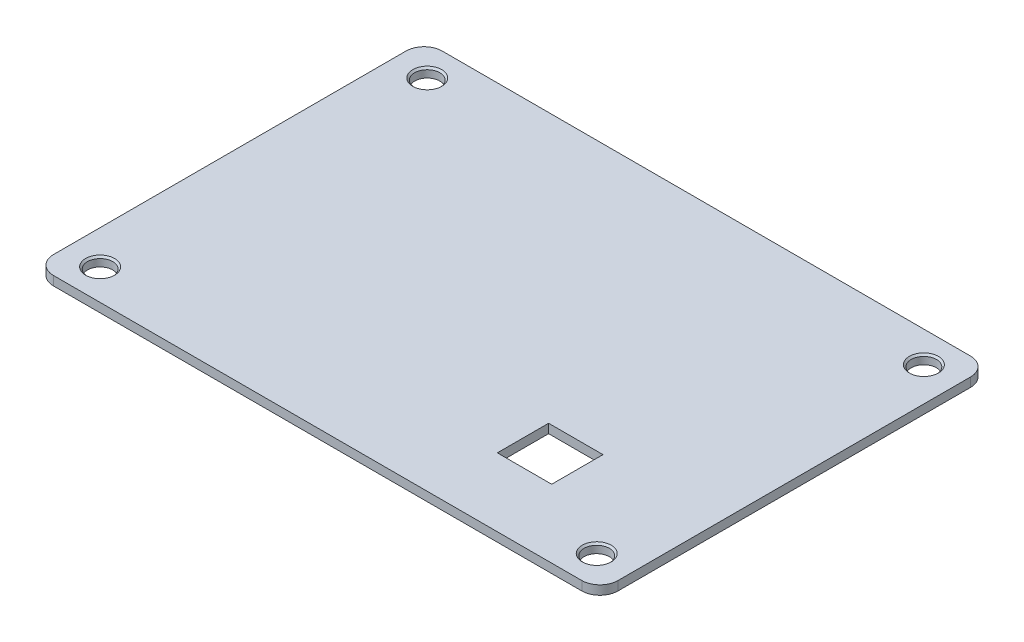
ISO-10303-21;
HEADER;
FILE_DESCRIPTION(('STEP AP214'),'2;1');
FILE_NAME('part.step','',(''),(''),'','','');
FILE_SCHEMA(('AUTOMOTIVE_DESIGN { 1 0 10303 214 1 1 1 1 }'));
ENDSEC;
DATA;
#1=APPLICATION_CONTEXT('core data for automotive mechanical design processes');
#2=APPLICATION_PROTOCOL_DEFINITION('international standard','automotive_design',2000,#1);
#3=PRODUCT_CONTEXT('',#1,'mechanical');
#4=PRODUCT('Part','Part','',(#3));
#5=PRODUCT_RELATED_PRODUCT_CATEGORY('part','',(#4));
#6=PRODUCT_DEFINITION_FORMATION('','',#4);
#7=PRODUCT_DEFINITION_CONTEXT('part definition',#1,'design');
#8=PRODUCT_DEFINITION('design','',#6,#7);
#9=PRODUCT_DEFINITION_SHAPE('','',#8);
#10=(LENGTH_UNIT() NAMED_UNIT(*) SI_UNIT(.MILLI.,.METRE.));
#11=(NAMED_UNIT(*) PLANE_ANGLE_UNIT() SI_UNIT($,.RADIAN.));
#12=(NAMED_UNIT(*) SI_UNIT($,.STERADIAN.) SOLID_ANGLE_UNIT());
#13=UNCERTAINTY_MEASURE_WITH_UNIT(LENGTH_MEASURE(1.E-05),#10,'distance_accuracy_value','');
#14=(GEOMETRIC_REPRESENTATION_CONTEXT(3) GLOBAL_UNCERTAINTY_ASSIGNED_CONTEXT((#13)) GLOBAL_UNIT_ASSIGNED_CONTEXT((#10,
#11,#12)) REPRESENTATION_CONTEXT('',''));
#15=CARTESIAN_POINT('',(0.,0.,0.));
#16=DIRECTION('',(0.,0.,1.));
#17=DIRECTION('',(1.,0.,0.));
#18=AXIS2_PLACEMENT_3D('',#15,#16,#17);
#19=CARTESIAN_POINT('',(0.,1.,0.));
#20=DIRECTION('',(0.,-1.,0.));
#21=DIRECTION('',(0.,0.,-1.));
#22=AXIS2_PLACEMENT_3D('',#19,#20,#21);
#23=PLANE('',#22);
#24=CARTESIAN_POINT('',(27.4,1.,-18.05));
#25=DIRECTION('',(0.,-1.,0.));
#26=DIRECTION('',(0.,0.,-1.));
#27=AXIS2_PLACEMENT_3D('',#24,#25,#26);
#28=CIRCLE('',#27,1.6);
#29=CARTESIAN_POINT('',(27.4,1.,-19.65));
#30=VERTEX_POINT('',#29);
#31=EDGE_CURVE('E247',#30,#30,#28,.T.);
#32=ORIENTED_EDGE('',*,*,#31,.T.);
#33=EDGE_LOOP('',(#32));
#34=FACE_BOUND('',#33,.T.);
#35=CARTESIAN_POINT('',(27.4,1.,18.05));
#36=DIRECTION('',(0.,-1.,0.));
#37=DIRECTION('',(0.,0.,-1.));
#38=AXIS2_PLACEMENT_3D('',#35,#36,#37);
#39=CIRCLE('',#38,1.6);
#40=CARTESIAN_POINT('',(27.4,1.,16.45));
#41=VERTEX_POINT('',#40);
#42=EDGE_CURVE('E244',#41,#41,#39,.T.);
#43=ORIENTED_EDGE('',*,*,#42,.T.);
#44=EDGE_LOOP('',(#43));
#45=FACE_BOUND('',#44,.T.);
#46=CARTESIAN_POINT('',(-27.4,1.,18.05));
#47=DIRECTION('',(0.,-1.,0.));
#48=DIRECTION('',(0.,0.,-1.));
#49=AXIS2_PLACEMENT_3D('',#46,#47,#48);
#50=CIRCLE('',#49,1.59999999999998);
#51=CARTESIAN_POINT('',(-27.4,1.,16.45));
#52=VERTEX_POINT('',#51);
#53=EDGE_CURVE('E241',#52,#52,#50,.T.);
#54=ORIENTED_EDGE('',*,*,#53,.T.);
#55=EDGE_LOOP('',(#54));
#56=FACE_BOUND('',#55,.T.);
#57=CARTESIAN_POINT('',(-27.4,1.,-18.05));
#58=DIRECTION('',(0.,-1.,0.));
#59=DIRECTION('',(0.,0.,-1.));
#60=AXIS2_PLACEMENT_3D('',#57,#58,#59);
#61=CIRCLE('',#60,1.6);
#62=CARTESIAN_POINT('',(-27.4,1.,-19.65));
#63=VERTEX_POINT('',#62);
#64=EDGE_CURVE('E238',#63,#63,#61,.T.);
#65=ORIENTED_EDGE('',*,*,#64,.T.);
#66=EDGE_LOOP('',(#65));
#67=FACE_BOUND('',#66,.T.);
#68=DIRECTION('',(0.,0.,-1.));
#69=VECTOR('',#68,1.);
#70=CARTESIAN_POINT('',(18.29,1.,13.91));
#71=LINE('',#70,#69);
#72=CARTESIAN_POINT('',(18.29,1.,13.91));
#73=VERTEX_POINT('',#72);
#74=CARTESIAN_POINT('',(18.29,1.,8.25));
#75=VERTEX_POINT('',#74);
#76=EDGE_CURVE('E146',#73,#75,#71,.T.);
#77=ORIENTED_EDGE('',*,*,#76,.F.);
#78=DIRECTION('',(1.,0.,0.));
#79=VECTOR('',#78,1.);
#80=CARTESIAN_POINT('',(12.29,1.,13.91));
#81=LINE('',#80,#79);
#82=CARTESIAN_POINT('',(12.29,1.,13.91));
#83=VERTEX_POINT('',#82);
#84=EDGE_CURVE('E151',#83,#73,#81,.T.);
#85=ORIENTED_EDGE('',*,*,#84,.F.);
#86=DIRECTION('',(0.,0.,-1.));
#87=VECTOR('',#86,1.);
#88=CARTESIAN_POINT('',(12.29,1.,13.91));
#89=LINE('',#88,#87);
#90=CARTESIAN_POINT('',(12.29,1.,8.25));
#91=VERTEX_POINT('',#90);
#92=EDGE_CURVE('E154',#83,#91,#89,.T.);
#93=ORIENTED_EDGE('',*,*,#92,.T.);
#94=DIRECTION('',(1.,0.,0.));
#95=VECTOR('',#94,1.);
#96=CARTESIAN_POINT('',(12.29,1.,8.25));
#97=LINE('',#96,#95);
#98=EDGE_CURVE('E135',#91,#75,#97,.T.);
#99=ORIENTED_EDGE('',*,*,#98,.T.);
#100=EDGE_LOOP('',(#77,#85,#93,#99));
#101=FACE_BOUND('',#100,.T.);
#102=DIRECTION('',(0.,0.,1.));
#103=VECTOR('',#102,1.);
#104=CARTESIAN_POINT('',(-31.15,1.,21.45));
#105=LINE('',#104,#103);
#106=CARTESIAN_POINT('',(-31.15,1.,-19.45));
#107=VERTEX_POINT('',#106);
#108=CARTESIAN_POINT('',(-31.15,1.,19.45));
#109=VERTEX_POINT('',#108);
#110=EDGE_CURVE('E169',#107,#109,#105,.T.);
#111=ORIENTED_EDGE('',*,*,#110,.T.);
#112=CARTESIAN_POINT('',(-29.15,1.,19.45));
#113=DIRECTION('',(0.,-1.,0.));
#114=DIRECTION('',(0.,0.,-1.));
#115=AXIS2_PLACEMENT_3D('',#112,#113,#114);
#116=CIRCLE('',#115,2.);
#117=CARTESIAN_POINT('',(-29.15,1.,21.45));
#118=VERTEX_POINT('',#117);
#119=EDGE_CURVE('E227',#109,#118,#116,.F.);
#120=ORIENTED_EDGE('',*,*,#119,.T.);
#121=DIRECTION('',(1.,0.,0.));
#122=VECTOR('',#121,1.);
#123=CARTESIAN_POINT('',(-31.15,1.,21.45));
#124=LINE('',#123,#122);
#125=CARTESIAN_POINT('',(29.15,1.,21.45));
#126=VERTEX_POINT('',#125);
#127=EDGE_CURVE('E172',#118,#126,#124,.T.);
#128=ORIENTED_EDGE('',*,*,#127,.T.);
#129=CARTESIAN_POINT('',(29.15,1.,19.45));
#130=DIRECTION('',(0.,-1.,0.));
#131=DIRECTION('',(0.,0.,-1.));
#132=AXIS2_PLACEMENT_3D('',#129,#130,#131);
#133=CIRCLE('',#132,2.);
#134=CARTESIAN_POINT('',(31.15,1.,19.45));
#135=VERTEX_POINT('',#134);
#136=EDGE_CURVE('E225',#126,#135,#133,.F.);
#137=ORIENTED_EDGE('',*,*,#136,.T.);
#138=DIRECTION('',(0.,0.,-1.));
#139=VECTOR('',#138,1.);
#140=CARTESIAN_POINT('',(31.15,1.,21.45));
#141=LINE('',#140,#139);
#142=CARTESIAN_POINT('',(31.15,1.,-19.45));
#143=VERTEX_POINT('',#142);
#144=EDGE_CURVE('E164',#135,#143,#141,.T.);
#145=ORIENTED_EDGE('',*,*,#144,.T.);
#146=CARTESIAN_POINT('',(29.15,1.,-19.45));
#147=DIRECTION('',(0.,-1.,0.));
#148=DIRECTION('',(0.,0.,-1.));
#149=AXIS2_PLACEMENT_3D('',#146,#147,#148);
#150=CIRCLE('',#149,2.);
#151=CARTESIAN_POINT('',(29.15,1.,-21.45));
#152=VERTEX_POINT('',#151);
#153=EDGE_CURVE('E61',#143,#152,#150,.F.);
#154=ORIENTED_EDGE('',*,*,#153,.T.);
#155=DIRECTION('',(-1.,0.,0.));
#156=VECTOR('',#155,1.);
#157=CARTESIAN_POINT('',(-31.15,1.,-21.45));
#158=LINE('',#157,#156);
#159=CARTESIAN_POINT('',(-29.15,1.,-21.45));
#160=VERTEX_POINT('',#159);
#161=EDGE_CURVE('E166',#152,#160,#158,.T.);
#162=ORIENTED_EDGE('',*,*,#161,.T.);
#163=CARTESIAN_POINT('',(-29.15,1.,-19.45));
#164=DIRECTION('',(0.,-1.,0.));
#165=DIRECTION('',(0.,0.,-1.));
#166=AXIS2_PLACEMENT_3D('',#163,#164,#165);
#167=CIRCLE('',#166,2.);
#168=EDGE_CURVE('E222',#160,#107,#167,.F.);
#169=ORIENTED_EDGE('',*,*,#168,.T.);
#170=EDGE_LOOP('',(#111,#120,#128,#137,#145,#154,#162,#169));
#171=FACE_BOUND('',#170,.T.);
#172=ADVANCED_FACE('F38',(#34,#45,#56,#67,#101,#171),#23,.F.);
#173=CARTESIAN_POINT('',(0.,0.,0.));
#174=DIRECTION('',(0.,-1.,0.));
#175=DIRECTION('',(0.,0.,-1.));
#176=AXIS2_PLACEMENT_3D('',#173,#174,#175);
#177=PLANE('',#176);
#178=CARTESIAN_POINT('',(-27.4,0.,18.05));
#179=DIRECTION('',(0.,-1.,0.));
#180=DIRECTION('',(0.,0.,-1.));
#181=AXIS2_PLACEMENT_3D('',#178,#179,#180);
#182=CIRCLE('',#181,1.4);
#183=CARTESIAN_POINT('',(-27.4,0.,16.65));
#184=VERTEX_POINT('',#183);
#185=EDGE_CURVE('E199',#184,#184,#182,.F.);
#186=ORIENTED_EDGE('',*,*,#185,.T.);
#187=EDGE_LOOP('',(#186));
#188=FACE_BOUND('',#187,.T.);
#189=CARTESIAN_POINT('',(27.4,0.,-18.05));
#190=DIRECTION('',(0.,-1.,0.));
#191=DIRECTION('',(0.,0.,-1.));
#192=AXIS2_PLACEMENT_3D('',#189,#190,#191);
#193=CIRCLE('',#192,1.4);
#194=CARTESIAN_POINT('',(27.4,0.,-19.45));
#195=VERTEX_POINT('',#194);
#196=EDGE_CURVE('E193',#195,#195,#193,.F.);
#197=ORIENTED_EDGE('',*,*,#196,.T.);
#198=EDGE_LOOP('',(#197));
#199=FACE_BOUND('',#198,.T.);
#200=DIRECTION('',(-1.,0.,0.));
#201=VECTOR('',#200,1.);
#202=CARTESIAN_POINT('',(0.,0.,13.91));
#203=LINE('',#202,#201);
#204=CARTESIAN_POINT('',(18.29,0.,13.91));
#205=VERTEX_POINT('',#204);
#206=CARTESIAN_POINT('',(12.29,0.,13.91));
#207=VERTEX_POINT('',#206);
#208=EDGE_CURVE('E190',#205,#207,#203,.T.);
#209=ORIENTED_EDGE('',*,*,#208,.F.);
#210=DIRECTION('',(0.,0.,1.));
#211=VECTOR('',#210,1.);
#212=CARTESIAN_POINT('',(18.29,0.,0.));
#213=LINE('',#212,#211);
#214=CARTESIAN_POINT('',(18.29,0.,8.25));
#215=VERTEX_POINT('',#214);
#216=EDGE_CURVE('E175',#215,#205,#213,.T.);
#217=ORIENTED_EDGE('',*,*,#216,.F.);
#218=DIRECTION('',(-1.,0.,0.));
#219=VECTOR('',#218,1.);
#220=CARTESIAN_POINT('',(0.,0.,8.25));
#221=LINE('',#220,#219);
#222=CARTESIAN_POINT('',(12.29,0.,8.25));
#223=VERTEX_POINT('',#222);
#224=EDGE_CURVE('E138',#215,#223,#221,.T.);
#225=ORIENTED_EDGE('',*,*,#224,.T.);
#226=DIRECTION('',(0.,0.,1.));
#227=VECTOR('',#226,1.);
#228=CARTESIAN_POINT('',(12.29,0.,0.));
#229=LINE('',#228,#227);
#230=EDGE_CURVE('E187',#223,#207,#229,.T.);
#231=ORIENTED_EDGE('',*,*,#230,.T.);
#232=EDGE_LOOP('',(#209,#217,#225,#231));
#233=FACE_BOUND('',#232,.T.);
#234=DIRECTION('',(1.,0.,0.));
#235=VECTOR('',#234,1.);
#236=CARTESIAN_POINT('',(-31.15,0.,21.45));
#237=LINE('',#236,#235);
#238=CARTESIAN_POINT('',(-29.15,0.,21.45));
#239=VERTEX_POINT('',#238);
#240=CARTESIAN_POINT('',(29.15,0.,21.45));
#241=VERTEX_POINT('',#240);
#242=EDGE_CURVE('E167',#239,#241,#237,.T.);
#243=ORIENTED_EDGE('',*,*,#242,.F.);
#244=CARTESIAN_POINT('',(-29.15,0.,19.45));
#245=DIRECTION('',(0.,-1.,0.));
#246=DIRECTION('',(0.,0.,-1.));
#247=AXIS2_PLACEMENT_3D('',#244,#245,#246);
#248=CIRCLE('',#247,2.);
#249=CARTESIAN_POINT('',(-31.15,0.,19.45));
#250=VERTEX_POINT('',#249);
#251=EDGE_CURVE('E215',#239,#250,#248,.T.);
#252=ORIENTED_EDGE('',*,*,#251,.T.);
#253=DIRECTION('',(0.,0.,1.));
#254=VECTOR('',#253,1.);
#255=CARTESIAN_POINT('',(-31.15,0.,21.45));
#256=LINE('',#255,#254);
#257=CARTESIAN_POINT('',(-31.15,0.,-19.45));
#258=VERTEX_POINT('',#257);
#259=EDGE_CURVE('E180',#258,#250,#256,.T.);
#260=ORIENTED_EDGE('',*,*,#259,.F.);
#261=CARTESIAN_POINT('',(-29.15,0.,-19.45));
#262=DIRECTION('',(0.,-1.,0.));
#263=DIRECTION('',(0.,0.,-1.));
#264=AXIS2_PLACEMENT_3D('',#261,#262,#263);
#265=CIRCLE('',#264,2.);
#266=CARTESIAN_POINT('',(-29.15,0.,-21.45));
#267=VERTEX_POINT('',#266);
#268=EDGE_CURVE('E209',#258,#267,#265,.T.);
#269=ORIENTED_EDGE('',*,*,#268,.T.);
#270=DIRECTION('',(-1.,0.,0.));
#271=VECTOR('',#270,1.);
#272=CARTESIAN_POINT('',(-31.15,0.,-21.45));
#273=LINE('',#272,#271);
#274=CARTESIAN_POINT('',(29.15,0.,-21.45));
#275=VERTEX_POINT('',#274);
#276=EDGE_CURVE('E178',#275,#267,#273,.T.);
#277=ORIENTED_EDGE('',*,*,#276,.F.);
#278=CARTESIAN_POINT('',(29.15,0.,-19.45));
#279=DIRECTION('',(0.,-1.,0.));
#280=DIRECTION('',(0.,0.,-1.));
#281=AXIS2_PLACEMENT_3D('',#278,#279,#280);
#282=CIRCLE('',#281,2.);
#283=CARTESIAN_POINT('',(31.15,0.,-19.45));
#284=VERTEX_POINT('',#283);
#285=EDGE_CURVE('E211',#275,#284,#282,.T.);
#286=ORIENTED_EDGE('',*,*,#285,.T.);
#287=DIRECTION('',(0.,0.,-1.));
#288=VECTOR('',#287,1.);
#289=CARTESIAN_POINT('',(31.15,0.,21.45));
#290=LINE('',#289,#288);
#291=CARTESIAN_POINT('',(31.15,0.,19.45));
#292=VERTEX_POINT('',#291);
#293=EDGE_CURVE('E161',#292,#284,#290,.T.);
#294=ORIENTED_EDGE('',*,*,#293,.F.);
#295=CARTESIAN_POINT('',(29.15,0.,19.45));
#296=DIRECTION('',(0.,-1.,0.));
#297=DIRECTION('',(0.,0.,-1.));
#298=AXIS2_PLACEMENT_3D('',#295,#296,#297);
#299=CIRCLE('',#298,2.);
#300=EDGE_CURVE('E213',#292,#241,#299,.T.);
#301=ORIENTED_EDGE('',*,*,#300,.T.);
#302=EDGE_LOOP('',(#243,#252,#260,#269,#277,#286,#294,#301));
#303=FACE_BOUND('',#302,.T.);
#304=CARTESIAN_POINT('',(27.4,0.,18.05));
#305=DIRECTION('',(0.,-1.,0.));
#306=DIRECTION('',(0.,0.,-1.));
#307=AXIS2_PLACEMENT_3D('',#304,#305,#306);
#308=CIRCLE('',#307,1.4);
#309=CARTESIAN_POINT('',(27.4,0.,16.65));
#310=VERTEX_POINT('',#309);
#311=EDGE_CURVE('E196',#310,#310,#308,.T.);
#312=ORIENTED_EDGE('',*,*,#311,.F.);
#313=EDGE_LOOP('',(#312));
#314=FACE_BOUND('',#313,.T.);
#315=CARTESIAN_POINT('',(-27.4,0.,-18.05));
#316=DIRECTION('',(0.,-1.,0.));
#317=DIRECTION('',(0.,0.,-1.));
#318=AXIS2_PLACEMENT_3D('',#315,#316,#317);
#319=CIRCLE('',#318,1.4);
#320=CARTESIAN_POINT('',(-27.4,0.,-19.45));
#321=VERTEX_POINT('',#320);
#322=EDGE_CURVE('E202',#321,#321,#319,.T.);
#323=ORIENTED_EDGE('',*,*,#322,.F.);
#324=EDGE_LOOP('',(#323));
#325=FACE_BOUND('',#324,.T.);
#326=ADVANCED_FACE('F269',(#188,#199,#233,#303,#314,#325),#177,.T.);
#327=CARTESIAN_POINT('',(31.15,1.,21.45));
#328=DIRECTION('',(-1.,0.,0.));
#329=DIRECTION('',(0.,0.,1.));
#330=AXIS2_PLACEMENT_3D('',#327,#328,#329);
#331=PLANE('',#330);
#332=ORIENTED_EDGE('',*,*,#144,.F.);
#333=DIRECTION('',(0.,-1.,0.));
#334=VECTOR('',#333,1.);
#335=CARTESIAN_POINT('',(31.15,1.,19.45));
#336=LINE('',#335,#334);
#337=EDGE_CURVE('E231',#135,#292,#336,.T.);
#338=ORIENTED_EDGE('',*,*,#337,.T.);
#339=ORIENTED_EDGE('',*,*,#293,.T.);
#340=DIRECTION('',(0.,-1.,0.));
#341=VECTOR('',#340,1.);
#342=CARTESIAN_POINT('',(31.15,1.,-19.45));
#343=LINE('',#342,#341);
#344=EDGE_CURVE('E229',#284,#143,#343,.F.);
#345=ORIENTED_EDGE('',*,*,#344,.T.);
#346=EDGE_LOOP('',(#332,#338,#339,#345));
#347=FACE_BOUND('',#346,.T.);
#348=ADVANCED_FACE('F286',(#347),#331,.F.);
#349=CARTESIAN_POINT('',(-31.15,1.,-21.45));
#350=DIRECTION('',(0.,0.,1.));
#351=DIRECTION('',(1.,0.,0.));
#352=AXIS2_PLACEMENT_3D('',#349,#350,#351);
#353=PLANE('',#352);
#354=ORIENTED_EDGE('',*,*,#161,.F.);
#355=DIRECTION('',(0.,-1.,0.));
#356=VECTOR('',#355,1.);
#357=CARTESIAN_POINT('',(29.15,1.,-21.45));
#358=LINE('',#357,#356);
#359=EDGE_CURVE('E235',#152,#275,#358,.T.);
#360=ORIENTED_EDGE('',*,*,#359,.T.);
#361=ORIENTED_EDGE('',*,*,#276,.T.);
#362=DIRECTION('',(0.,-1.,0.));
#363=VECTOR('',#362,1.);
#364=CARTESIAN_POINT('',(-29.15,1.,-21.45));
#365=LINE('',#364,#363);
#366=EDGE_CURVE('E54',#267,#160,#365,.F.);
#367=ORIENTED_EDGE('',*,*,#366,.T.);
#368=EDGE_LOOP('',(#354,#360,#361,#367));
#369=FACE_BOUND('',#368,.T.);
#370=ADVANCED_FACE('F292',(#369),#353,.F.);
#371=CARTESIAN_POINT('',(-31.15,1.,21.45));
#372=DIRECTION('',(1.,0.,0.));
#373=DIRECTION('',(0.,0.,-1.));
#374=AXIS2_PLACEMENT_3D('',#371,#372,#373);
#375=PLANE('',#374);
#376=ORIENTED_EDGE('',*,*,#259,.T.);
#377=DIRECTION('',(0.,-1.,0.));
#378=VECTOR('',#377,1.);
#379=CARTESIAN_POINT('',(-31.15,1.,19.45));
#380=LINE('',#379,#378);
#381=EDGE_CURVE('E220',#250,#109,#380,.F.);
#382=ORIENTED_EDGE('',*,*,#381,.T.);
#383=ORIENTED_EDGE('',*,*,#110,.F.);
#384=DIRECTION('',(0.,-1.,0.));
#385=VECTOR('',#384,1.);
#386=CARTESIAN_POINT('',(-31.15,1.,-19.45));
#387=LINE('',#386,#385);
#388=EDGE_CURVE('E217',#107,#258,#387,.T.);
#389=ORIENTED_EDGE('',*,*,#388,.T.);
#390=EDGE_LOOP('',(#376,#382,#383,#389));
#391=FACE_BOUND('',#390,.T.);
#392=ADVANCED_FACE('F302',(#391),#375,.F.);
#393=CARTESIAN_POINT('',(-31.15,1.,21.45));
#394=DIRECTION('',(0.,0.,-1.));
#395=DIRECTION('',(-1.,0.,0.));
#396=AXIS2_PLACEMENT_3D('',#393,#394,#395);
#397=PLANE('',#396);
#398=ORIENTED_EDGE('',*,*,#127,.F.);
#399=DIRECTION('',(0.,-1.,0.));
#400=VECTOR('',#399,1.);
#401=CARTESIAN_POINT('',(-29.15,1.,21.45));
#402=LINE('',#401,#400);
#403=EDGE_CURVE('E206',#118,#239,#402,.T.);
#404=ORIENTED_EDGE('',*,*,#403,.T.);
#405=ORIENTED_EDGE('',*,*,#242,.T.);
#406=DIRECTION('',(0.,-1.,0.));
#407=VECTOR('',#406,1.);
#408=CARTESIAN_POINT('',(29.15,1.,21.45));
#409=LINE('',#408,#407);
#410=EDGE_CURVE('E192',#241,#126,#409,.F.);
#411=ORIENTED_EDGE('',*,*,#410,.T.);
#412=EDGE_LOOP('',(#398,#404,#405,#411));
#413=FACE_BOUND('',#412,.T.);
#414=ADVANCED_FACE('F298',(#413),#397,.F.);
#415=CARTESIAN_POINT('',(12.29,-6.,13.91));
#416=DIRECTION('',(0.,0.,1.));
#417=DIRECTION('',(1.,0.,0.));
#418=AXIS2_PLACEMENT_3D('',#415,#416,#417);
#419=PLANE('',#418);
#420=ORIENTED_EDGE('',*,*,#208,.T.);
#421=DIRECTION('',(0.,1.,0.));
#422=VECTOR('',#421,1.);
#423=CARTESIAN_POINT('',(12.29,-6.,13.91));
#424=LINE('',#423,#422);
#425=EDGE_CURVE('E159',#207,#83,#424,.T.);
#426=ORIENTED_EDGE('',*,*,#425,.T.);
#427=ORIENTED_EDGE('',*,*,#84,.T.);
#428=DIRECTION('',(0.,1.,0.));
#429=VECTOR('',#428,1.);
#430=CARTESIAN_POINT('',(18.29,-6.,13.91));
#431=LINE('',#430,#429);
#432=EDGE_CURVE('E142',#205,#73,#431,.T.);
#433=ORIENTED_EDGE('',*,*,#432,.F.);
#434=EDGE_LOOP('',(#420,#426,#427,#433));
#435=FACE_BOUND('',#434,.T.);
#436=ADVANCED_FACE('F301',(#435),#419,.F.);
#437=CARTESIAN_POINT('',(12.29,-6.,13.91));
#438=DIRECTION('',(1.,0.,0.));
#439=DIRECTION('',(0.,0.,-1.));
#440=AXIS2_PLACEMENT_3D('',#437,#438,#439);
#441=PLANE('',#440);
#442=DIRECTION('',(0.,1.,0.));
#443=VECTOR('',#442,1.);
#444=CARTESIAN_POINT('',(12.29,-6.,8.25));
#445=LINE('',#444,#443);
#446=EDGE_CURVE('E141',#223,#91,#445,.T.);
#447=ORIENTED_EDGE('',*,*,#446,.T.);
#448=ORIENTED_EDGE('',*,*,#92,.F.);
#449=ORIENTED_EDGE('',*,*,#425,.F.);
#450=ORIENTED_EDGE('',*,*,#230,.F.);
#451=EDGE_LOOP('',(#447,#448,#449,#450));
#452=FACE_BOUND('',#451,.T.);
#453=ADVANCED_FACE('F362',(#452),#441,.T.);
#454=CARTESIAN_POINT('',(12.29,-6.,8.25));
#455=DIRECTION('',(0.,0.,1.));
#456=DIRECTION('',(1.,0.,0.));
#457=AXIS2_PLACEMENT_3D('',#454,#455,#456);
#458=PLANE('',#457);
#459=DIRECTION('',(0.,1.,0.));
#460=VECTOR('',#459,1.);
#461=CARTESIAN_POINT('',(18.29,-6.,8.25));
#462=LINE('',#461,#460);
#463=EDGE_CURVE('E130',#215,#75,#462,.T.);
#464=ORIENTED_EDGE('',*,*,#463,.T.);
#465=ORIENTED_EDGE('',*,*,#98,.F.);
#466=ORIENTED_EDGE('',*,*,#446,.F.);
#467=ORIENTED_EDGE('',*,*,#224,.F.);
#468=EDGE_LOOP('',(#464,#465,#466,#467));
#469=FACE_BOUND('',#468,.T.);
#470=ADVANCED_FACE('F132',(#469),#458,.T.);
#471=CARTESIAN_POINT('',(18.29,-6.,13.91));
#472=DIRECTION('',(1.,0.,0.));
#473=DIRECTION('',(0.,0.,-1.));
#474=AXIS2_PLACEMENT_3D('',#471,#472,#473);
#475=PLANE('',#474);
#476=ORIENTED_EDGE('',*,*,#216,.T.);
#477=ORIENTED_EDGE('',*,*,#432,.T.);
#478=ORIENTED_EDGE('',*,*,#76,.T.);
#479=ORIENTED_EDGE('',*,*,#463,.F.);
#480=EDGE_LOOP('',(#476,#477,#478,#479));
#481=FACE_BOUND('',#480,.T.);
#482=ADVANCED_FACE('F147',(#481),#475,.F.);
#483=CARTESIAN_POINT('',(27.4,-9.,-18.05));
#484=DIRECTION('',(0.,1.,0.));
#485=DIRECTION('',(0.,0.,1.));
#486=AXIS2_PLACEMENT_3D('',#483,#484,#485);
#487=CYLINDRICAL_SURFACE('',#486,1.4);
#488=CARTESIAN_POINT('',(27.4,0.79999999999999,-18.05));
#489=DIRECTION('',(0.,-1.,0.));
#490=DIRECTION('',(0.,0.,-1.));
#491=AXIS2_PLACEMENT_3D('',#488,#489,#490);
#492=CIRCLE('',#491,1.4);
#493=CARTESIAN_POINT('',(27.4,0.79999999999999,-19.45));
#494=VERTEX_POINT('',#493);
#495=EDGE_CURVE('E250',#494,#494,#492,.F.);
#496=ORIENTED_EDGE('',*,*,#495,.T.);
#497=EDGE_LOOP('',(#496));
#498=FACE_BOUND('',#497,.T.);
#499=ORIENTED_EDGE('',*,*,#196,.F.);
#500=EDGE_LOOP('',(#499));
#501=FACE_BOUND('',#500,.T.);
#502=ADVANCED_FACE('F350',(#498,#501),#487,.F.);
#503=CARTESIAN_POINT('',(27.4,-9.,18.05));
#504=DIRECTION('',(0.,1.,0.));
#505=DIRECTION('',(0.,0.,1.));
#506=AXIS2_PLACEMENT_3D('',#503,#504,#505);
#507=CYLINDRICAL_SURFACE('',#506,1.4);
#508=CARTESIAN_POINT('',(27.4,0.800000000000004,18.05));
#509=DIRECTION('',(0.,-1.,0.));
#510=DIRECTION('',(0.,0.,-1.));
#511=AXIS2_PLACEMENT_3D('',#508,#509,#510);
#512=CIRCLE('',#511,1.4);
#513=CARTESIAN_POINT('',(27.4,0.800000000000004,16.65));
#514=VERTEX_POINT('',#513);
#515=EDGE_CURVE('E253',#514,#514,#512,.F.);
#516=ORIENTED_EDGE('',*,*,#515,.T.);
#517=EDGE_LOOP('',(#516));
#518=FACE_BOUND('',#517,.T.);
#519=ORIENTED_EDGE('',*,*,#311,.T.);
#520=EDGE_LOOP('',(#519));
#521=FACE_BOUND('',#520,.T.);
#522=ADVANCED_FACE('F347',(#518,#521),#507,.F.);
#523=CARTESIAN_POINT('',(-27.4,-9.,18.05));
#524=DIRECTION('',(0.,1.,0.));
#525=DIRECTION('',(0.,0.,1.));
#526=AXIS2_PLACEMENT_3D('',#523,#524,#525);
#527=CYLINDRICAL_SURFACE('',#526,1.4);
#528=CARTESIAN_POINT('',(-27.4,0.800000000000011,18.05));
#529=DIRECTION('',(0.,-1.,0.));
#530=DIRECTION('',(0.,0.,-1.));
#531=AXIS2_PLACEMENT_3D('',#528,#529,#530);
#532=CIRCLE('',#531,1.4);
#533=CARTESIAN_POINT('',(-27.4,0.800000000000011,16.65));
#534=VERTEX_POINT('',#533);
#535=EDGE_CURVE('E47',#534,#534,#532,.F.);
#536=ORIENTED_EDGE('',*,*,#535,.T.);
#537=EDGE_LOOP('',(#536));
#538=FACE_BOUND('',#537,.T.);
#539=ORIENTED_EDGE('',*,*,#185,.F.);
#540=EDGE_LOOP('',(#539));
#541=FACE_BOUND('',#540,.T.);
#542=ADVANCED_FACE('F258',(#538,#541),#527,.F.);
#543=CARTESIAN_POINT('',(-27.4,-9.,-18.05));
#544=DIRECTION('',(0.,1.,0.));
#545=DIRECTION('',(0.,0.,1.));
#546=AXIS2_PLACEMENT_3D('',#543,#544,#545);
#547=CYLINDRICAL_SURFACE('',#546,1.4);
#548=CARTESIAN_POINT('',(-27.4,0.800000000000004,-18.05));
#549=DIRECTION('',(0.,-1.,0.));
#550=DIRECTION('',(0.,0.,-1.));
#551=AXIS2_PLACEMENT_3D('',#548,#549,#550);
#552=CIRCLE('',#551,1.4);
#553=CARTESIAN_POINT('',(-27.4,0.800000000000004,-19.45));
#554=VERTEX_POINT('',#553);
#555=EDGE_CURVE('E11',#554,#554,#552,.F.);
#556=ORIENTED_EDGE('',*,*,#555,.T.);
#557=EDGE_LOOP('',(#556));
#558=FACE_BOUND('',#557,.T.);
#559=ORIENTED_EDGE('',*,*,#322,.T.);
#560=EDGE_LOOP('',(#559));
#561=FACE_BOUND('',#560,.T.);
#562=ADVANCED_FACE('F278',(#558,#561),#547,.F.);
#563=CARTESIAN_POINT('',(-29.15,1.,19.45));
#564=DIRECTION('',(0.,-1.,0.));
#565=DIRECTION('',(0.,0.,-1.));
#566=AXIS2_PLACEMENT_3D('',#563,#564,#565);
#567=CYLINDRICAL_SURFACE('',#566,2.);
#568=ORIENTED_EDGE('',*,*,#119,.F.);
#569=ORIENTED_EDGE('',*,*,#381,.F.);
#570=ORIENTED_EDGE('',*,*,#251,.F.);
#571=ORIENTED_EDGE('',*,*,#403,.F.);
#572=EDGE_LOOP('',(#568,#569,#570,#571));
#573=FACE_BOUND('',#572,.T.);
#574=ADVANCED_FACE('F281',(#573),#567,.T.);
#575=CARTESIAN_POINT('',(29.15,1.,19.45));
#576=DIRECTION('',(0.,-1.,0.));
#577=DIRECTION('',(0.,0.,-1.));
#578=AXIS2_PLACEMENT_3D('',#575,#576,#577);
#579=CYLINDRICAL_SURFACE('',#578,2.);
#580=ORIENTED_EDGE('',*,*,#136,.F.);
#581=ORIENTED_EDGE('',*,*,#410,.F.);
#582=ORIENTED_EDGE('',*,*,#300,.F.);
#583=ORIENTED_EDGE('',*,*,#337,.F.);
#584=EDGE_LOOP('',(#580,#581,#582,#583));
#585=FACE_BOUND('',#584,.T.);
#586=ADVANCED_FACE('F311',(#585),#579,.T.);
#587=CARTESIAN_POINT('',(29.15,1.,-19.45));
#588=DIRECTION('',(0.,-1.,0.));
#589=DIRECTION('',(0.,0.,-1.));
#590=AXIS2_PLACEMENT_3D('',#587,#588,#589);
#591=CYLINDRICAL_SURFACE('',#590,2.);
#592=ORIENTED_EDGE('',*,*,#153,.F.);
#593=ORIENTED_EDGE('',*,*,#344,.F.);
#594=ORIENTED_EDGE('',*,*,#285,.F.);
#595=ORIENTED_EDGE('',*,*,#359,.F.);
#596=EDGE_LOOP('',(#592,#593,#594,#595));
#597=FACE_BOUND('',#596,.T.);
#598=ADVANCED_FACE('F315',(#597),#591,.T.);
#599=CARTESIAN_POINT('',(-29.15,1.,-19.45));
#600=DIRECTION('',(0.,-1.,0.));
#601=DIRECTION('',(0.,0.,-1.));
#602=AXIS2_PLACEMENT_3D('',#599,#600,#601);
#603=CYLINDRICAL_SURFACE('',#602,2.);
#604=ORIENTED_EDGE('',*,*,#168,.F.);
#605=ORIENTED_EDGE('',*,*,#366,.F.);
#606=ORIENTED_EDGE('',*,*,#268,.F.);
#607=ORIENTED_EDGE('',*,*,#388,.F.);
#608=EDGE_LOOP('',(#604,#605,#606,#607));
#609=FACE_BOUND('',#608,.T.);
#610=ADVANCED_FACE('F319',(#609),#603,.T.);
#611=CARTESIAN_POINT('',(27.4,1.,-18.05));
#612=DIRECTION('',(0.,1.,0.));
#613=DIRECTION('',(0.,0.,1.));
#614=AXIS2_PLACEMENT_3D('',#611,#612,#613);
#615=CONICAL_SURFACE('',#614,1.6,0.785398163397434);
#616=ORIENTED_EDGE('',*,*,#495,.F.);
#617=EDGE_LOOP('',(#616));
#618=FACE_BOUND('',#617,.T.);
#619=ORIENTED_EDGE('',*,*,#31,.F.);
#620=EDGE_LOOP('',(#619));
#621=FACE_BOUND('',#620,.T.);
#622=ADVANCED_FACE('F323',(#618,#621),#615,.F.);
#623=CARTESIAN_POINT('',(27.4,0.800000000000004,18.05));
#624=DIRECTION('',(0.,1.,0.));
#625=DIRECTION('',(0.,0.,1.));
#626=AXIS2_PLACEMENT_3D('',#623,#624,#625);
#627=CONICAL_SURFACE('',#626,1.4,0.785398163397451);
#628=ORIENTED_EDGE('',*,*,#42,.F.);
#629=EDGE_LOOP('',(#628));
#630=FACE_BOUND('',#629,.T.);
#631=ORIENTED_EDGE('',*,*,#515,.F.);
#632=EDGE_LOOP('',(#631));
#633=FACE_BOUND('',#632,.T.);
#634=ADVANCED_FACE('F264',(#630,#633),#627,.F.);
#635=CARTESIAN_POINT('',(-27.4,1.,18.05));
#636=DIRECTION('',(0.,1.,0.));
#637=DIRECTION('',(0.,0.,1.));
#638=AXIS2_PLACEMENT_3D('',#635,#636,#637);
#639=CONICAL_SURFACE('',#638,1.59999999999998,0.785398163397434);
#640=ORIENTED_EDGE('',*,*,#535,.F.);
#641=EDGE_LOOP('',(#640));
#642=FACE_BOUND('',#641,.T.);
#643=ORIENTED_EDGE('',*,*,#53,.F.);
#644=EDGE_LOOP('',(#643));
#645=FACE_BOUND('',#644,.T.);
#646=ADVANCED_FACE('F261',(#642,#645),#639,.F.);
#647=CARTESIAN_POINT('',(-27.4,0.800000000000004,-18.05));
#648=DIRECTION('',(0.,1.,0.));
#649=DIRECTION('',(0.,0.,1.));
#650=AXIS2_PLACEMENT_3D('',#647,#648,#649);
#651=CONICAL_SURFACE('',#650,1.4,0.785398163397451);
#652=ORIENTED_EDGE('',*,*,#64,.F.);
#653=EDGE_LOOP('',(#652));
#654=FACE_BOUND('',#653,.T.);
#655=ORIENTED_EDGE('',*,*,#555,.F.);
#656=EDGE_LOOP('',(#655));
#657=FACE_BOUND('',#656,.T.);
#658=ADVANCED_FACE('F41',(#654,#657),#651,.F.);
#659=CLOSED_SHELL('',(#172,#326,#348,#370,#392,#414,#436,#453,#470,#482,#502,#522,#542,#562,
#574,#586,#598,#610,#622,#634,#646,#658));
#660=MANIFOLD_SOLID_BREP('B2',#659);
#661=ADVANCED_BREP_SHAPE_REPRESENTATION('',(#18,#660),#14);
#662=SHAPE_DEFINITION_REPRESENTATION(#9,#661);
ENDSEC;
END-ISO-10303-21;
